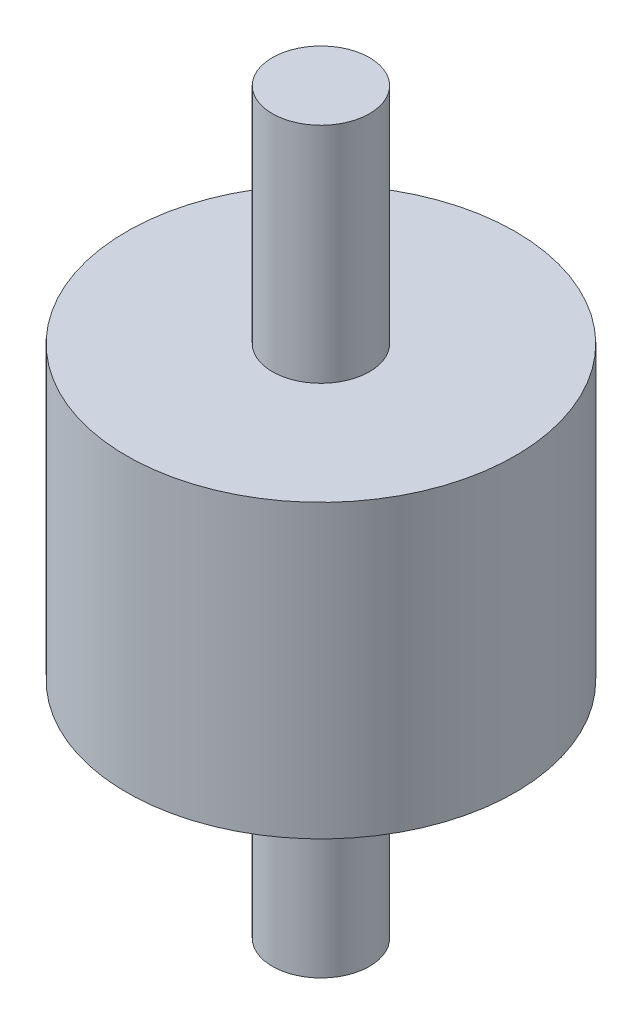
ISO-10303-21;
HEADER;
FILE_DESCRIPTION(('STEP AP214'),'2;1');
FILE_NAME('part.step','',(''),(''),'','','');
FILE_SCHEMA(('AUTOMOTIVE_DESIGN { 1 0 10303 214 1 1 1 1 }'));
ENDSEC;
DATA;
#1=APPLICATION_CONTEXT('core data for automotive mechanical design processes');
#2=APPLICATION_PROTOCOL_DEFINITION('international standard','automotive_design',2000,#1);
#3=PRODUCT_CONTEXT('',#1,'mechanical');
#4=PRODUCT('Part','Part','',(#3));
#5=PRODUCT_RELATED_PRODUCT_CATEGORY('part','',(#4));
#6=PRODUCT_DEFINITION_FORMATION('','',#4);
#7=PRODUCT_DEFINITION_CONTEXT('part definition',#1,'design');
#8=PRODUCT_DEFINITION('design','',#6,#7);
#9=PRODUCT_DEFINITION_SHAPE('','',#8);
#10=(LENGTH_UNIT() NAMED_UNIT(*) SI_UNIT(.MILLI.,.METRE.));
#11=(NAMED_UNIT(*) PLANE_ANGLE_UNIT() SI_UNIT($,.RADIAN.));
#12=(NAMED_UNIT(*) SI_UNIT($,.STERADIAN.) SOLID_ANGLE_UNIT());
#13=UNCERTAINTY_MEASURE_WITH_UNIT(LENGTH_MEASURE(1.E-05),#10,'distance_accuracy_value','');
#14=(GEOMETRIC_REPRESENTATION_CONTEXT(3) GLOBAL_UNCERTAINTY_ASSIGNED_CONTEXT((#13)) GLOBAL_UNIT_ASSIGNED_CONTEXT((#10,
#11,#12)) REPRESENTATION_CONTEXT('',''));
#15=CARTESIAN_POINT('',(0.,0.,0.));
#16=DIRECTION('',(0.,0.,1.));
#17=DIRECTION('',(1.,0.,0.));
#18=AXIS2_PLACEMENT_3D('',#15,#16,#17);
#19=CARTESIAN_POINT('',(0.,38.,0.));
#20=DIRECTION('',(0.,1.,0.));
#21=DIRECTION('',(0.,0.,1.));
#22=AXIS2_PLACEMENT_3D('',#19,#20,#21);
#23=PLANE('',#22);
#24=CARTESIAN_POINT('',(0.,38.,0.));
#25=DIRECTION('',(0.,-1.,0.));
#26=DIRECTION('',(0.,0.,-1.));
#27=AXIS2_PLACEMENT_3D('',#24,#25,#26);
#28=CIRCLE('',#27,5.);
#29=CARTESIAN_POINT('',(0.,38.,-5.));
#30=VERTEX_POINT('',#29);
#31=EDGE_CURVE('E10',#30,#30,#28,.T.);
#32=ORIENTED_EDGE('',*,*,#31,.F.);
#33=EDGE_LOOP('',(#32));
#34=FACE_BOUND('',#33,.T.);
#35=ADVANCED_FACE('F37',(#34),#23,.T.);
#36=CARTESIAN_POINT('',(0.,0.,0.));
#37=DIRECTION('',(0.,-1.,0.));
#38=DIRECTION('',(0.,0.,-1.));
#39=AXIS2_PLACEMENT_3D('',#36,#37,#38);
#40=CYLINDRICAL_SURFACE('',#39,5.);
#41=ORIENTED_EDGE('',*,*,#31,.T.);
#42=EDGE_LOOP('',(#41));
#43=FACE_BOUND('',#42,.T.);
#44=CARTESIAN_POINT('',(0.,15.,0.));
#45=DIRECTION('',(0.,-1.,0.));
#46=DIRECTION('',(0.,0.,-1.));
#47=AXIS2_PLACEMENT_3D('',#44,#45,#46);
#48=CIRCLE('',#47,5.);
#49=CARTESIAN_POINT('',(0.,15.,-5.));
#50=VERTEX_POINT('',#49);
#51=EDGE_CURVE('E43',#50,#50,#48,.T.);
#52=ORIENTED_EDGE('',*,*,#51,.F.);
#53=EDGE_LOOP('',(#52));
#54=FACE_BOUND('',#53,.T.);
#55=ADVANCED_FACE('F83',(#43,#54),#40,.T.);
#56=CARTESIAN_POINT('',(5.,15.,0.));
#57=DIRECTION('',(0.,1.,0.));
#58=DIRECTION('',(0.,0.,1.));
#59=AXIS2_PLACEMENT_3D('',#56,#57,#58);
#60=PLANE('',#59);
#61=ORIENTED_EDGE('',*,*,#51,.T.);
#62=EDGE_LOOP('',(#61));
#63=FACE_BOUND('',#62,.T.);
#64=CARTESIAN_POINT('',(0.,15.,0.));
#65=DIRECTION('',(0.,-1.,0.));
#66=DIRECTION('',(0.,0.,-1.));
#67=AXIS2_PLACEMENT_3D('',#64,#65,#66);
#68=CIRCLE('',#67,20.);
#69=CARTESIAN_POINT('',(0.,15.,-20.));
#70=VERTEX_POINT('',#69);
#71=EDGE_CURVE('E48',#70,#70,#68,.T.);
#72=ORIENTED_EDGE('',*,*,#71,.F.);
#73=EDGE_LOOP('',(#72));
#74=FACE_BOUND('',#73,.T.);
#75=ADVANCED_FACE('F73',(#63,#74),#60,.T.);
#76=CARTESIAN_POINT('',(0.,0.,0.));
#77=DIRECTION('',(0.,-1.,0.));
#78=DIRECTION('',(0.,0.,-1.));
#79=AXIS2_PLACEMENT_3D('',#76,#77,#78);
#80=CYLINDRICAL_SURFACE('',#79,20.);
#81=ORIENTED_EDGE('',*,*,#71,.T.);
#82=EDGE_LOOP('',(#81));
#83=FACE_BOUND('',#82,.T.);
#84=CARTESIAN_POINT('',(0.,-15.,0.));
#85=DIRECTION('',(0.,-1.,0.));
#86=DIRECTION('',(0.,0.,-1.));
#87=AXIS2_PLACEMENT_3D('',#84,#85,#86);
#88=CIRCLE('',#87,20.);
#89=CARTESIAN_POINT('',(0.,-15.,-20.));
#90=VERTEX_POINT('',#89);
#91=EDGE_CURVE('E64',#90,#90,#88,.T.);
#92=ORIENTED_EDGE('',*,*,#91,.F.);
#93=EDGE_LOOP('',(#92));
#94=FACE_BOUND('',#93,.T.);
#95=ADVANCED_FACE('F70',(#83,#94),#80,.T.);
#96=CARTESIAN_POINT('',(0.,-38.,0.));
#97=DIRECTION('',(0.,-1.,0.));
#98=DIRECTION('',(0.,0.,1.));
#99=AXIS2_PLACEMENT_3D('',#96,#97,#98);
#100=PLANE('',#99);
#101=CARTESIAN_POINT('',(0.,-38.,0.));
#102=DIRECTION('',(0.,-1.,0.));
#103=DIRECTION('',(0.,0.,-1.));
#104=AXIS2_PLACEMENT_3D('',#101,#102,#103);
#105=CIRCLE('',#104,5.);
#106=CARTESIAN_POINT('',(0.,-38.,-5.));
#107=VERTEX_POINT('',#106);
#108=EDGE_CURVE('E54',#107,#107,#105,.T.);
#109=ORIENTED_EDGE('',*,*,#108,.T.);
#110=EDGE_LOOP('',(#109));
#111=FACE_BOUND('',#110,.T.);
#112=ADVANCED_FACE('F72',(#111),#100,.T.);
#113=CARTESIAN_POINT('',(0.,0.,0.));
#114=DIRECTION('',(0.,1.,0.));
#115=DIRECTION('',(0.,0.,-1.));
#116=AXIS2_PLACEMENT_3D('',#113,#114,#115);
#117=CYLINDRICAL_SURFACE('',#116,5.);
#118=ORIENTED_EDGE('',*,*,#108,.F.);
#119=EDGE_LOOP('',(#118));
#120=FACE_BOUND('',#119,.T.);
#121=CARTESIAN_POINT('',(0.,-15.,0.));
#122=DIRECTION('',(0.,-1.,0.));
#123=DIRECTION('',(0.,0.,-1.));
#124=AXIS2_PLACEMENT_3D('',#121,#122,#123);
#125=CIRCLE('',#124,5.);
#126=CARTESIAN_POINT('',(0.,-15.,-5.));
#127=VERTEX_POINT('',#126);
#128=EDGE_CURVE('E60',#127,#127,#125,.T.);
#129=ORIENTED_EDGE('',*,*,#128,.T.);
#130=EDGE_LOOP('',(#129));
#131=FACE_BOUND('',#130,.T.);
#132=ADVANCED_FACE('F80',(#120,#131),#117,.T.);
#133=CARTESIAN_POINT('',(5.,-15.,0.));
#134=DIRECTION('',(0.,-1.,0.));
#135=DIRECTION('',(0.,0.,1.));
#136=AXIS2_PLACEMENT_3D('',#133,#134,#135);
#137=PLANE('',#136);
#138=ORIENTED_EDGE('',*,*,#128,.F.);
#139=EDGE_LOOP('',(#138));
#140=FACE_BOUND('',#139,.T.);
#141=ORIENTED_EDGE('',*,*,#91,.T.);
#142=EDGE_LOOP('',(#141));
#143=FACE_BOUND('',#142,.T.);
#144=ADVANCED_FACE('F68',(#140,#143),#137,.T.);
#145=CLOSED_SHELL('',(#35,#55,#75,#95,#112,#132,#144));
#146=MANIFOLD_SOLID_BREP('B2',#145);
#147=ADVANCED_BREP_SHAPE_REPRESENTATION('',(#18,#146),#14);
#148=SHAPE_DEFINITION_REPRESENTATION(#9,#147);
ENDSEC;
END-ISO-10303-21;
